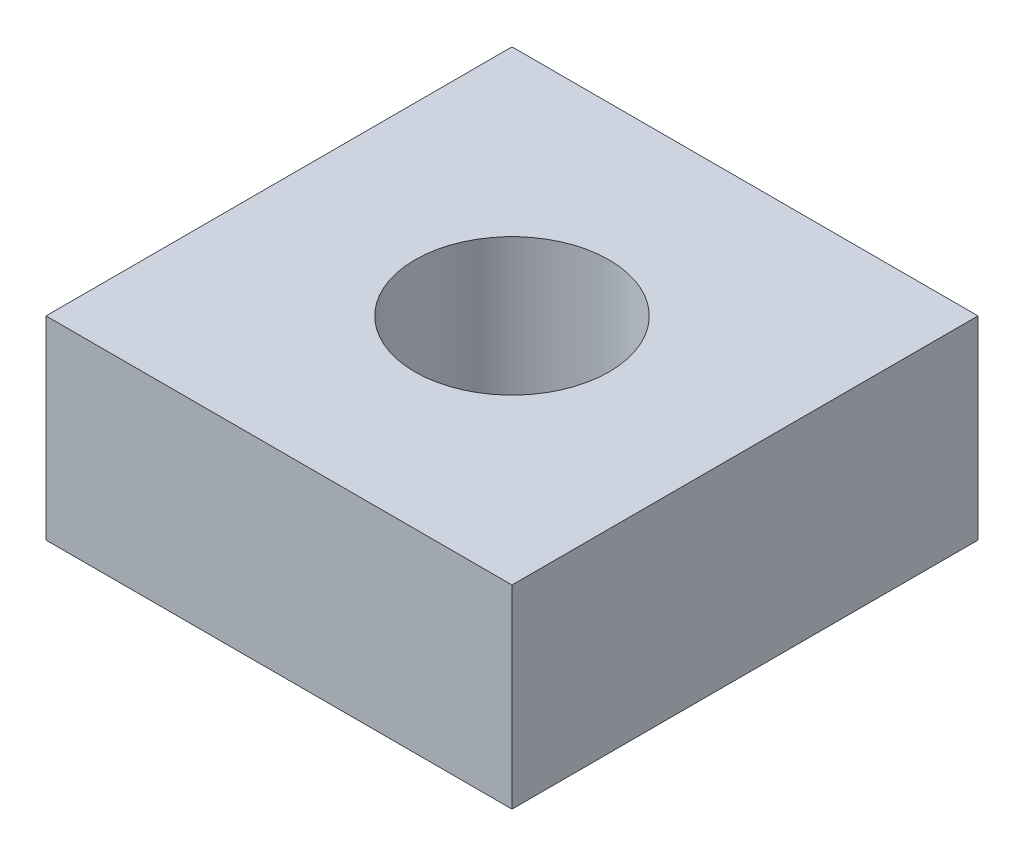
ISO-10303-21;
HEADER;
FILE_DESCRIPTION(('STEP AP214'),'2;1');
FILE_NAME('part.step','',(''),(''),'','','');
FILE_SCHEMA(('AUTOMOTIVE_DESIGN { 1 0 10303 214 1 1 1 1 }'));
ENDSEC;
DATA;
#1=APPLICATION_CONTEXT('core data for automotive mechanical design processes');
#2=APPLICATION_PROTOCOL_DEFINITION('international standard','automotive_design',2000,#1);
#3=PRODUCT_CONTEXT('',#1,'mechanical');
#4=PRODUCT('Part','Part','',(#3));
#5=PRODUCT_RELATED_PRODUCT_CATEGORY('part','',(#4));
#6=PRODUCT_DEFINITION_FORMATION('','',#4);
#7=PRODUCT_DEFINITION_CONTEXT('part definition',#1,'design');
#8=PRODUCT_DEFINITION('design','',#6,#7);
#9=PRODUCT_DEFINITION_SHAPE('','',#8);
#10=(LENGTH_UNIT() NAMED_UNIT(*) SI_UNIT(.MILLI.,.METRE.));
#11=(NAMED_UNIT(*) PLANE_ANGLE_UNIT() SI_UNIT($,.RADIAN.));
#12=(NAMED_UNIT(*) SI_UNIT($,.STERADIAN.) SOLID_ANGLE_UNIT());
#13=UNCERTAINTY_MEASURE_WITH_UNIT(LENGTH_MEASURE(1.E-05),#10,'distance_accuracy_value','');
#14=(GEOMETRIC_REPRESENTATION_CONTEXT(3) GLOBAL_UNCERTAINTY_ASSIGNED_CONTEXT((#13)) GLOBAL_UNIT_ASSIGNED_CONTEXT((#10,
#11,#12)) REPRESENTATION_CONTEXT('',''));
#15=CARTESIAN_POINT('',(0.,0.,0.));
#16=DIRECTION('',(0.,0.,1.));
#17=DIRECTION('',(1.,0.,0.));
#18=AXIS2_PLACEMENT_3D('',#15,#16,#17);
#19=CARTESIAN_POINT('',(60.,50.,60.));
#20=DIRECTION('',(-1.,0.,0.));
#21=DIRECTION('',(0.,0.,1.));
#22=AXIS2_PLACEMENT_3D('',#19,#20,#21);
#23=PLANE('',#22);
#24=DIRECTION('',(0.,0.,-1.));
#25=VECTOR('',#24,1.);
#26=CARTESIAN_POINT('',(60.,0.,60.));
#27=LINE('',#26,#25);
#28=CARTESIAN_POINT('',(60.,0.,60.));
#29=VERTEX_POINT('',#28);
#30=CARTESIAN_POINT('',(60.,0.,-60.));
#31=VERTEX_POINT('',#30);
#32=EDGE_CURVE('E100',#29,#31,#27,.T.);
#33=ORIENTED_EDGE('',*,*,#32,.T.);
#34=DIRECTION('',(0.,-1.,0.));
#35=VECTOR('',#34,1.);
#36=CARTESIAN_POINT('',(60.,50.,-60.));
#37=LINE('',#36,#35);
#38=CARTESIAN_POINT('',(60.,50.,-60.));
#39=VERTEX_POINT('',#38);
#40=EDGE_CURVE('E11',#39,#31,#37,.T.);
#41=ORIENTED_EDGE('',*,*,#40,.F.);
#42=DIRECTION('',(0.,0.,-1.));
#43=VECTOR('',#42,1.);
#44=CARTESIAN_POINT('',(60.,50.,60.));
#45=LINE('',#44,#43);
#46=CARTESIAN_POINT('',(60.,50.,60.));
#47=VERTEX_POINT('',#46);
#48=EDGE_CURVE('E88',#47,#39,#45,.T.);
#49=ORIENTED_EDGE('',*,*,#48,.F.);
#50=DIRECTION('',(0.,-1.,0.));
#51=VECTOR('',#50,1.);
#52=CARTESIAN_POINT('',(60.,50.,60.));
#53=LINE('',#52,#51);
#54=EDGE_CURVE('E96',#47,#29,#53,.T.);
#55=ORIENTED_EDGE('',*,*,#54,.T.);
#56=EDGE_LOOP('',(#33,#41,#49,#55));
#57=FACE_BOUND('',#56,.T.);
#58=ADVANCED_FACE('F37',(#57),#23,.F.);
#59=CARTESIAN_POINT('',(-60.,50.,-60.));
#60=DIRECTION('',(0.,0.,1.));
#61=DIRECTION('',(1.,0.,0.));
#62=AXIS2_PLACEMENT_3D('',#59,#60,#61);
#63=PLANE('',#62);
#64=DIRECTION('',(-1.,0.,0.));
#65=VECTOR('',#64,1.);
#66=CARTESIAN_POINT('',(-60.,0.,-60.));
#67=LINE('',#66,#65);
#68=CARTESIAN_POINT('',(-60.,0.,-60.));
#69=VERTEX_POINT('',#68);
#70=EDGE_CURVE('E92',#31,#69,#67,.T.);
#71=ORIENTED_EDGE('',*,*,#70,.T.);
#72=DIRECTION('',(0.,-1.,0.));
#73=VECTOR('',#72,1.);
#74=CARTESIAN_POINT('',(-60.,50.,-60.));
#75=LINE('',#74,#73);
#76=CARTESIAN_POINT('',(-60.,50.,-60.));
#77=VERTEX_POINT('',#76);
#78=EDGE_CURVE('E45',#77,#69,#75,.T.);
#79=ORIENTED_EDGE('',*,*,#78,.F.);
#80=DIRECTION('',(-1.,0.,0.));
#81=VECTOR('',#80,1.);
#82=CARTESIAN_POINT('',(-60.,50.,-60.));
#83=LINE('',#82,#81);
#84=EDGE_CURVE('E83',#39,#77,#83,.T.);
#85=ORIENTED_EDGE('',*,*,#84,.F.);
#86=ORIENTED_EDGE('',*,*,#40,.T.);
#87=EDGE_LOOP('',(#71,#79,#85,#86));
#88=FACE_BOUND('',#87,.T.);
#89=ADVANCED_FACE('F91',(#88),#63,.F.);
#90=CARTESIAN_POINT('',(-60.,50.,60.));
#91=DIRECTION('',(1.,0.,0.));
#92=DIRECTION('',(0.,0.,-1.));
#93=AXIS2_PLACEMENT_3D('',#90,#91,#92);
#94=PLANE('',#93);
#95=DIRECTION('',(0.,0.,1.));
#96=VECTOR('',#95,1.);
#97=CARTESIAN_POINT('',(-60.,0.,60.));
#98=LINE('',#97,#96);
#99=CARTESIAN_POINT('',(-60.,0.,60.));
#100=VERTEX_POINT('',#99);
#101=EDGE_CURVE('E70',#69,#100,#98,.T.);
#102=ORIENTED_EDGE('',*,*,#101,.T.);
#103=DIRECTION('',(0.,-1.,0.));
#104=VECTOR('',#103,1.);
#105=CARTESIAN_POINT('',(-60.,50.,60.));
#106=LINE('',#105,#104);
#107=CARTESIAN_POINT('',(-60.,50.,60.));
#108=VERTEX_POINT('',#107);
#109=EDGE_CURVE('E93',#108,#100,#106,.T.);
#110=ORIENTED_EDGE('',*,*,#109,.F.);
#111=DIRECTION('',(0.,0.,1.));
#112=VECTOR('',#111,1.);
#113=CARTESIAN_POINT('',(-60.,50.,60.));
#114=LINE('',#113,#112);
#115=EDGE_CURVE('E86',#77,#108,#114,.T.);
#116=ORIENTED_EDGE('',*,*,#115,.F.);
#117=ORIENTED_EDGE('',*,*,#78,.T.);
#118=EDGE_LOOP('',(#102,#110,#116,#117));
#119=FACE_BOUND('',#118,.T.);
#120=ADVANCED_FACE('F94',(#119),#94,.F.);
#121=CARTESIAN_POINT('',(-60.,50.,60.));
#122=DIRECTION('',(0.,0.,-1.));
#123=DIRECTION('',(-1.,0.,0.));
#124=AXIS2_PLACEMENT_3D('',#121,#122,#123);
#125=PLANE('',#124);
#126=DIRECTION('',(1.,0.,0.));
#127=VECTOR('',#126,1.);
#128=CARTESIAN_POINT('',(-60.,0.,60.));
#129=LINE('',#128,#127);
#130=EDGE_CURVE('E76',#100,#29,#129,.T.);
#131=ORIENTED_EDGE('',*,*,#130,.T.);
#132=ORIENTED_EDGE('',*,*,#54,.F.);
#133=DIRECTION('',(1.,0.,0.));
#134=VECTOR('',#133,1.);
#135=CARTESIAN_POINT('',(-60.,50.,60.));
#136=LINE('',#135,#134);
#137=EDGE_CURVE('E53',#108,#47,#136,.T.);
#138=ORIENTED_EDGE('',*,*,#137,.F.);
#139=ORIENTED_EDGE('',*,*,#109,.T.);
#140=EDGE_LOOP('',(#131,#132,#138,#139));
#141=FACE_BOUND('',#140,.T.);
#142=ADVANCED_FACE('F108',(#141),#125,.F.);
#143=CARTESIAN_POINT('',(0.,50.,0.));
#144=DIRECTION('',(0.,-1.,0.));
#145=DIRECTION('',(0.,0.,-1.));
#146=AXIS2_PLACEMENT_3D('',#143,#144,#145);
#147=PLANE('',#146);
#148=CARTESIAN_POINT('',(0.,50.,0.));
#149=DIRECTION('',(0.,1.,0.));
#150=DIRECTION('',(0.,0.,1.));
#151=AXIS2_PLACEMENT_3D('',#148,#149,#150);
#152=CIRCLE('',#151,25.);
#153=CARTESIAN_POINT('',(0.,50.,25.));
#154=VERTEX_POINT('',#153);
#155=EDGE_CURVE('E114',#154,#154,#152,.T.);
#156=ORIENTED_EDGE('',*,*,#155,.F.);
#157=EDGE_LOOP('',(#156));
#158=FACE_BOUND('',#157,.T.);
#159=ORIENTED_EDGE('',*,*,#48,.T.);
#160=ORIENTED_EDGE('',*,*,#84,.T.);
#161=ORIENTED_EDGE('',*,*,#115,.T.);
#162=ORIENTED_EDGE('',*,*,#137,.T.);
#163=EDGE_LOOP('',(#159,#160,#161,#162));
#164=FACE_BOUND('',#163,.T.);
#165=ADVANCED_FACE('F84',(#158,#164),#147,.F.);
#166=CARTESIAN_POINT('',(0.,0.,0.));
#167=DIRECTION('',(0.,-1.,0.));
#168=DIRECTION('',(0.,0.,-1.));
#169=AXIS2_PLACEMENT_3D('',#166,#167,#168);
#170=PLANE('',#169);
#171=CARTESIAN_POINT('',(0.,0.,0.));
#172=DIRECTION('',(0.,1.,0.));
#173=DIRECTION('',(0.,0.,1.));
#174=AXIS2_PLACEMENT_3D('',#171,#172,#173);
#175=CIRCLE('',#174,25.);
#176=CARTESIAN_POINT('',(0.,0.,25.));
#177=VERTEX_POINT('',#176);
#178=EDGE_CURVE('E103',#177,#177,#175,.T.);
#179=ORIENTED_EDGE('',*,*,#178,.T.);
#180=EDGE_LOOP('',(#179));
#181=FACE_BOUND('',#180,.T.);
#182=ORIENTED_EDGE('',*,*,#32,.F.);
#183=ORIENTED_EDGE('',*,*,#130,.F.);
#184=ORIENTED_EDGE('',*,*,#101,.F.);
#185=ORIENTED_EDGE('',*,*,#70,.F.);
#186=EDGE_LOOP('',(#182,#183,#184,#185));
#187=FACE_BOUND('',#186,.T.);
#188=ADVANCED_FACE('F111',(#181,#187),#170,.T.);
#189=CARTESIAN_POINT('',(0.,0.,0.));
#190=DIRECTION('',(0.,1.,0.));
#191=DIRECTION('',(0.,0.,1.));
#192=AXIS2_PLACEMENT_3D('',#189,#190,#191);
#193=CYLINDRICAL_SURFACE('',#192,25.);
#194=ORIENTED_EDGE('',*,*,#178,.F.);
#195=EDGE_LOOP('',(#194));
#196=FACE_BOUND('',#195,.T.);
#197=ORIENTED_EDGE('',*,*,#155,.T.);
#198=EDGE_LOOP('',(#197));
#199=FACE_BOUND('',#198,.T.);
#200=ADVANCED_FACE('F121',(#196,#199),#193,.F.);
#201=CLOSED_SHELL('',(#58,#89,#120,#142,#165,#188,#200));
#202=MANIFOLD_SOLID_BREP('B2',#201);
#203=ADVANCED_BREP_SHAPE_REPRESENTATION('',(#18,#202),#14);
#204=SHAPE_DEFINITION_REPRESENTATION(#9,#203);
ENDSEC;
END-ISO-10303-21;
